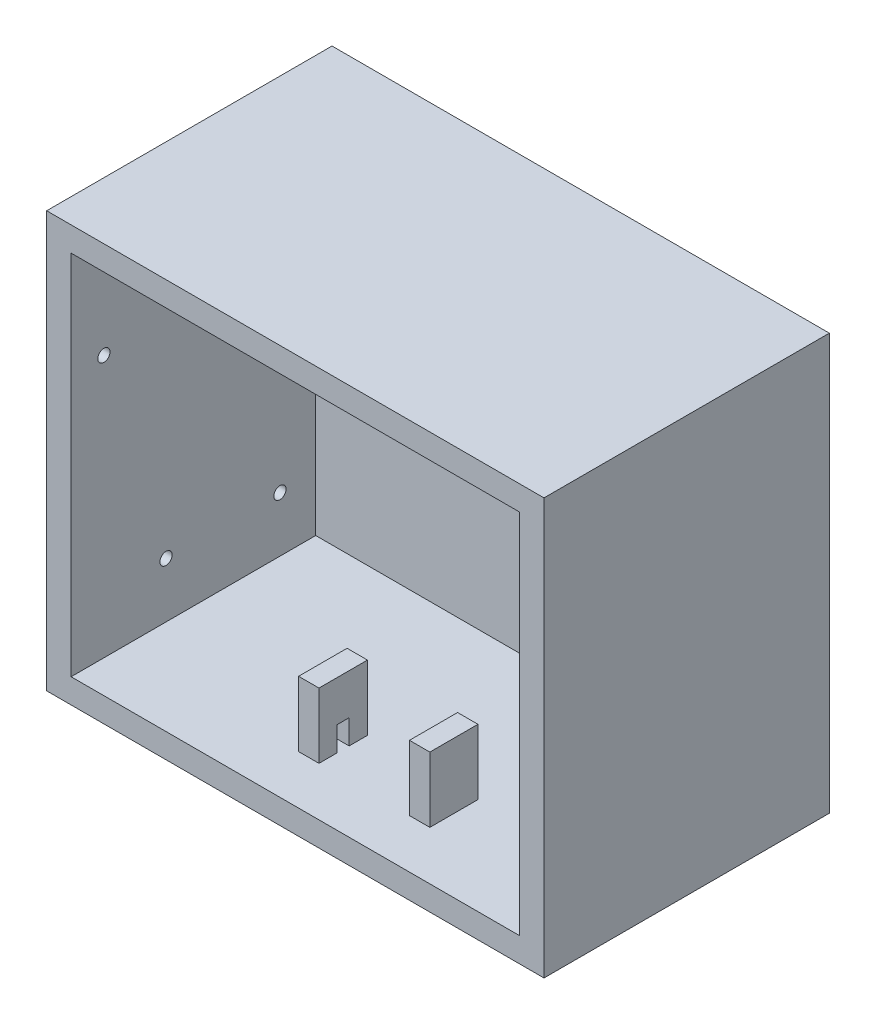
ISO-10303-21;
HEADER;
FILE_DESCRIPTION(('STEP AP214'),'2;1');
FILE_NAME('part.step','',(''),(''),'','','');
FILE_SCHEMA(('AUTOMOTIVE_DESIGN { 1 0 10303 214 1 1 1 1 }'));
ENDSEC;
DATA;
#1=APPLICATION_CONTEXT('core data for automotive mechanical design processes');
#2=APPLICATION_PROTOCOL_DEFINITION('international standard','automotive_design',2000,#1);
#3=PRODUCT_CONTEXT('',#1,'mechanical');
#4=PRODUCT('Part','Part','',(#3));
#5=PRODUCT_RELATED_PRODUCT_CATEGORY('part','',(#4));
#6=PRODUCT_DEFINITION_FORMATION('','',#4);
#7=PRODUCT_DEFINITION_CONTEXT('part definition',#1,'design');
#8=PRODUCT_DEFINITION('design','',#6,#7);
#9=PRODUCT_DEFINITION_SHAPE('','',#8);
#10=(LENGTH_UNIT() NAMED_UNIT(*) SI_UNIT(.MILLI.,.METRE.));
#11=(NAMED_UNIT(*) PLANE_ANGLE_UNIT() SI_UNIT($,.RADIAN.));
#12=(NAMED_UNIT(*) SI_UNIT($,.STERADIAN.) SOLID_ANGLE_UNIT());
#13=UNCERTAINTY_MEASURE_WITH_UNIT(LENGTH_MEASURE(1.E-05),#10,'distance_accuracy_value','');
#14=(GEOMETRIC_REPRESENTATION_CONTEXT(3) GLOBAL_UNCERTAINTY_ASSIGNED_CONTEXT((#13)) GLOBAL_UNIT_ASSIGNED_CONTEXT((#10,
#11,#12)) REPRESENTATION_CONTEXT('',''));
#15=CARTESIAN_POINT('',(0.,0.,0.));
#16=DIRECTION('',(0.,0.,1.));
#17=DIRECTION('',(1.,0.,0.));
#18=AXIS2_PLACEMENT_3D('',#15,#16,#17);
#19=CARTESIAN_POINT('',(0.,0.,70.));
#20=DIRECTION('',(0.,0.,1.));
#21=DIRECTION('',(1.,0.,0.));
#22=AXIS2_PLACEMENT_3D('',#19,#20,#21);
#23=PLANE('',#22);
#24=DIRECTION('',(0.,1.,0.));
#25=VECTOR('',#24,1.);
#26=CARTESIAN_POINT('',(61.,-51.,70.));
#27=LINE('',#26,#25);
#28=CARTESIAN_POINT('',(61.,-51.,70.));
#29=VERTEX_POINT('',#28);
#30=CARTESIAN_POINT('',(61.,51.,70.));
#31=VERTEX_POINT('',#30);
#32=EDGE_CURVE('E293',#29,#31,#27,.T.);
#33=ORIENTED_EDGE('',*,*,#32,.T.);
#34=DIRECTION('',(-1.,0.,0.));
#35=VECTOR('',#34,1.);
#36=CARTESIAN_POINT('',(61.,51.,70.));
#37=LINE('',#36,#35);
#38=CARTESIAN_POINT('',(-61.,51.,70.));
#39=VERTEX_POINT('',#38);
#40=EDGE_CURVE('E296',#31,#39,#37,.T.);
#41=ORIENTED_EDGE('',*,*,#40,.T.);
#42=DIRECTION('',(0.,-1.,0.));
#43=VECTOR('',#42,1.);
#44=CARTESIAN_POINT('',(-61.,-51.,70.));
#45=LINE('',#44,#43);
#46=CARTESIAN_POINT('',(-61.,-51.,70.));
#47=VERTEX_POINT('',#46);
#48=EDGE_CURVE('E299',#39,#47,#45,.T.);
#49=ORIENTED_EDGE('',*,*,#48,.T.);
#50=DIRECTION('',(1.,0.,0.));
#51=VECTOR('',#50,1.);
#52=CARTESIAN_POINT('',(61.,-51.,70.));
#53=LINE('',#52,#51);
#54=EDGE_CURVE('E301',#47,#29,#53,.T.);
#55=ORIENTED_EDGE('',*,*,#54,.T.);
#56=EDGE_LOOP('',(#33,#41,#49,#55));
#57=FACE_BOUND('',#56,.T.);
#58=DIRECTION('',(1.,0.,0.));
#59=VECTOR('',#58,1.);
#60=CARTESIAN_POINT('',(55.,-45.,70.));
#61=LINE('',#60,#59);
#62=CARTESIAN_POINT('',(-55.,-45.,70.));
#63=VERTEX_POINT('',#62);
#64=CARTESIAN_POINT('',(55.,-45.,70.));
#65=VERTEX_POINT('',#64);
#66=EDGE_CURVE('E274',#63,#65,#61,.T.);
#67=ORIENTED_EDGE('',*,*,#66,.F.);
#68=DIRECTION('',(0.,-1.,0.));
#69=VECTOR('',#68,1.);
#70=CARTESIAN_POINT('',(-55.,-45.,70.));
#71=LINE('',#70,#69);
#72=CARTESIAN_POINT('',(-55.,45.,70.));
#73=VERTEX_POINT('',#72);
#74=EDGE_CURVE('E272',#73,#63,#71,.T.);
#75=ORIENTED_EDGE('',*,*,#74,.F.);
#76=DIRECTION('',(-1.,0.,0.));
#77=VECTOR('',#76,1.);
#78=CARTESIAN_POINT('',(55.,45.,70.));
#79=LINE('',#78,#77);
#80=CARTESIAN_POINT('',(55.,45.,70.));
#81=VERTEX_POINT('',#80);
#82=EDGE_CURVE('E279',#81,#73,#79,.T.);
#83=ORIENTED_EDGE('',*,*,#82,.F.);
#84=DIRECTION('',(0.,1.,0.));
#85=VECTOR('',#84,1.);
#86=CARTESIAN_POINT('',(55.,-45.,70.));
#87=LINE('',#86,#85);
#88=EDGE_CURVE('E276',#65,#81,#87,.T.);
#89=ORIENTED_EDGE('',*,*,#88,.F.);
#90=EDGE_LOOP('',(#67,#75,#83,#89));
#91=FACE_BOUND('',#90,.T.);
#92=ADVANCED_FACE('F33',(#57,#91),#23,.T.);
#93=CARTESIAN_POINT('',(0.,0.,0.));
#94=DIRECTION('',(0.,0.,1.));
#95=DIRECTION('',(1.,0.,0.));
#96=AXIS2_PLACEMENT_3D('',#93,#94,#95);
#97=PLANE('',#96);
#98=DIRECTION('',(0.,1.,0.));
#99=VECTOR('',#98,1.);
#100=CARTESIAN_POINT('',(61.,-51.,0.));
#101=LINE('',#100,#99);
#102=CARTESIAN_POINT('',(61.,-51.,0.));
#103=VERTEX_POINT('',#102);
#104=CARTESIAN_POINT('',(61.,51.,0.));
#105=VERTEX_POINT('',#104);
#106=EDGE_CURVE('E292',#103,#105,#101,.T.);
#107=ORIENTED_EDGE('',*,*,#106,.F.);
#108=DIRECTION('',(1.,0.,0.));
#109=VECTOR('',#108,1.);
#110=CARTESIAN_POINT('',(61.,-51.,0.));
#111=LINE('',#110,#109);
#112=CARTESIAN_POINT('',(-61.,-51.,0.));
#113=VERTEX_POINT('',#112);
#114=EDGE_CURVE('E297',#113,#103,#111,.T.);
#115=ORIENTED_EDGE('',*,*,#114,.F.);
#116=DIRECTION('',(0.,-1.,0.));
#117=VECTOR('',#116,1.);
#118=CARTESIAN_POINT('',(-61.,-51.,0.));
#119=LINE('',#118,#117);
#120=CARTESIAN_POINT('',(-61.,51.,0.));
#121=VERTEX_POINT('',#120);
#122=EDGE_CURVE('E309',#121,#113,#119,.T.);
#123=ORIENTED_EDGE('',*,*,#122,.F.);
#124=DIRECTION('',(-1.,0.,0.));
#125=VECTOR('',#124,1.);
#126=CARTESIAN_POINT('',(61.,51.,0.));
#127=LINE('',#126,#125);
#128=EDGE_CURVE('E306',#105,#121,#127,.T.);
#129=ORIENTED_EDGE('',*,*,#128,.F.);
#130=EDGE_LOOP('',(#107,#115,#123,#129));
#131=FACE_BOUND('',#130,.T.);
#132=ADVANCED_FACE('F383',(#131),#97,.F.);
#133=CARTESIAN_POINT('',(61.,-51.,70.));
#134=DIRECTION('',(-1.,0.,0.));
#135=DIRECTION('',(0.,0.,1.));
#136=AXIS2_PLACEMENT_3D('',#133,#134,#135);
#137=PLANE('',#136);
#138=DIRECTION('',(0.,0.,-1.));
#139=VECTOR('',#138,1.);
#140=CARTESIAN_POINT('',(61.,-51.,70.));
#141=LINE('',#140,#139);
#142=EDGE_CURVE('E303',#29,#103,#141,.T.);
#143=ORIENTED_EDGE('',*,*,#142,.T.);
#144=ORIENTED_EDGE('',*,*,#106,.T.);
#145=DIRECTION('',(0.,0.,-1.));
#146=VECTOR('',#145,1.);
#147=CARTESIAN_POINT('',(61.,51.,70.));
#148=LINE('',#147,#146);
#149=EDGE_CURVE('E319',#31,#105,#148,.T.);
#150=ORIENTED_EDGE('',*,*,#149,.F.);
#151=ORIENTED_EDGE('',*,*,#32,.F.);
#152=EDGE_LOOP('',(#143,#144,#150,#151));
#153=FACE_BOUND('',#152,.T.);
#154=ADVANCED_FACE('F35',(#153),#137,.F.);
#155=CARTESIAN_POINT('',(61.,51.,70.));
#156=DIRECTION('',(0.,-1.,0.));
#157=DIRECTION('',(1.,0.,0.));
#158=AXIS2_PLACEMENT_3D('',#155,#156,#157);
#159=PLANE('',#158);
#160=ORIENTED_EDGE('',*,*,#149,.T.);
#161=ORIENTED_EDGE('',*,*,#128,.T.);
#162=DIRECTION('',(0.,0.,-1.));
#163=VECTOR('',#162,1.);
#164=CARTESIAN_POINT('',(-61.,51.,70.));
#165=LINE('',#164,#163);
#166=EDGE_CURVE('E317',#39,#121,#165,.T.);
#167=ORIENTED_EDGE('',*,*,#166,.F.);
#168=ORIENTED_EDGE('',*,*,#40,.F.);
#169=EDGE_LOOP('',(#160,#161,#167,#168));
#170=FACE_BOUND('',#169,.T.);
#171=ADVANCED_FACE('F402',(#170),#159,.F.);
#172=CARTESIAN_POINT('',(-61.,-51.,70.));
#173=DIRECTION('',(1.,0.,0.));
#174=DIRECTION('',(0.,0.,-1.));
#175=AXIS2_PLACEMENT_3D('',#172,#173,#174);
#176=PLANE('',#175);
#177=CARTESIAN_POINT('',(-61.,19.26,13.7));
#178=DIRECTION('',(-1.,0.,0.));
#179=DIRECTION('',(0.,0.,1.));
#180=AXIS2_PLACEMENT_3D('',#177,#178,#179);
#181=CIRCLE('',#180,1.5);
#182=CARTESIAN_POINT('',(-61.,19.26,15.2));
#183=VERTEX_POINT('',#182);
#184=EDGE_CURVE('E239',#183,#183,#181,.T.);
#185=ORIENTED_EDGE('',*,*,#184,.F.);
#186=EDGE_LOOP('',(#185));
#187=FACE_BOUND('',#186,.T.);
#188=CARTESIAN_POINT('',(-61.,19.26,61.96));
#189=DIRECTION('',(-1.,0.,0.));
#190=DIRECTION('',(0.,0.,1.));
#191=AXIS2_PLACEMENT_3D('',#188,#189,#190);
#192=CIRCLE('',#191,1.49999999999999);
#193=CARTESIAN_POINT('',(-61.,19.26,63.46));
#194=VERTEX_POINT('',#193);
#195=EDGE_CURVE('E251',#194,#194,#192,.T.);
#196=ORIENTED_EDGE('',*,*,#195,.F.);
#197=EDGE_LOOP('',(#196));
#198=FACE_BOUND('',#197,.T.);
#199=CARTESIAN_POINT('',(-61.,-31.5,18.78));
#200=DIRECTION('',(-1.,0.,0.));
#201=DIRECTION('',(0.,0.,1.));
#202=AXIS2_PLACEMENT_3D('',#199,#200,#201);
#203=CIRCLE('',#202,1.5);
#204=CARTESIAN_POINT('',(-61.,-31.5,20.28));
#205=VERTEX_POINT('',#204);
#206=EDGE_CURVE('E255',#205,#205,#203,.T.);
#207=ORIENTED_EDGE('',*,*,#206,.F.);
#208=EDGE_LOOP('',(#207));
#209=FACE_BOUND('',#208,.T.);
#210=CARTESIAN_POINT('',(-61.,-31.5,46.72));
#211=DIRECTION('',(-1.,0.,0.));
#212=DIRECTION('',(0.,0.,1.));
#213=AXIS2_PLACEMENT_3D('',#210,#211,#212);
#214=CIRCLE('',#213,1.5);
#215=CARTESIAN_POINT('',(-61.,-31.5,48.22));
#216=VERTEX_POINT('',#215);
#217=EDGE_CURVE('E259',#216,#216,#214,.T.);
#218=ORIENTED_EDGE('',*,*,#217,.F.);
#219=EDGE_LOOP('',(#218));
#220=FACE_BOUND('',#219,.T.);
#221=ORIENTED_EDGE('',*,*,#166,.T.);
#222=ORIENTED_EDGE('',*,*,#122,.T.);
#223=DIRECTION('',(0.,0.,-1.));
#224=VECTOR('',#223,1.);
#225=CARTESIAN_POINT('',(-61.,-51.,70.));
#226=LINE('',#225,#224);
#227=EDGE_CURVE('E315',#47,#113,#226,.T.);
#228=ORIENTED_EDGE('',*,*,#227,.F.);
#229=ORIENTED_EDGE('',*,*,#48,.F.);
#230=EDGE_LOOP('',(#221,#222,#228,#229));
#231=FACE_BOUND('',#230,.T.);
#232=ADVANCED_FACE('F399',(#187,#198,#209,#220,#231),#176,.F.);
#233=CARTESIAN_POINT('',(61.,-51.,70.));
#234=DIRECTION('',(0.,1.,0.));
#235=DIRECTION('',(-1.,0.,0.));
#236=AXIS2_PLACEMENT_3D('',#233,#234,#235);
#237=PLANE('',#236);
#238=ORIENTED_EDGE('',*,*,#227,.T.);
#239=ORIENTED_EDGE('',*,*,#114,.T.);
#240=ORIENTED_EDGE('',*,*,#142,.F.);
#241=ORIENTED_EDGE('',*,*,#54,.F.);
#242=EDGE_LOOP('',(#238,#239,#240,#241));
#243=FACE_BOUND('',#242,.T.);
#244=ADVANCED_FACE('F396',(#243),#237,.F.);
#245=CARTESIAN_POINT('',(-55.,-45.,70.));
#246=DIRECTION('',(1.,0.,0.));
#247=DIRECTION('',(0.,0.,-1.));
#248=AXIS2_PLACEMENT_3D('',#245,#246,#247);
#249=PLANE('',#248);
#250=CARTESIAN_POINT('',(-55.,19.26,13.7));
#251=DIRECTION('',(1.,0.,0.));
#252=DIRECTION('',(0.,0.,-1.));
#253=AXIS2_PLACEMENT_3D('',#250,#251,#252);
#254=CIRCLE('',#253,1.5);
#255=CARTESIAN_POINT('',(-55.,19.26,12.2));
#256=VERTEX_POINT('',#255);
#257=EDGE_CURVE('E250',#256,#256,#254,.T.);
#258=ORIENTED_EDGE('',*,*,#257,.F.);
#259=EDGE_LOOP('',(#258));
#260=FACE_BOUND('',#259,.T.);
#261=CARTESIAN_POINT('',(-55.,19.26,61.96));
#262=DIRECTION('',(1.,0.,0.));
#263=DIRECTION('',(0.,0.,-1.));
#264=AXIS2_PLACEMENT_3D('',#261,#262,#263);
#265=CIRCLE('',#264,1.49999999999999);
#266=CARTESIAN_POINT('',(-55.,19.26,60.46));
#267=VERTEX_POINT('',#266);
#268=EDGE_CURVE('E254',#267,#267,#265,.T.);
#269=ORIENTED_EDGE('',*,*,#268,.F.);
#270=EDGE_LOOP('',(#269));
#271=FACE_BOUND('',#270,.T.);
#272=CARTESIAN_POINT('',(-55.,-31.5,18.78));
#273=DIRECTION('',(1.,0.,0.));
#274=DIRECTION('',(0.,0.,-1.));
#275=AXIS2_PLACEMENT_3D('',#272,#273,#274);
#276=CIRCLE('',#275,1.5);
#277=CARTESIAN_POINT('',(-55.,-31.5,17.28));
#278=VERTEX_POINT('',#277);
#279=EDGE_CURVE('E266',#278,#278,#276,.T.);
#280=ORIENTED_EDGE('',*,*,#279,.F.);
#281=EDGE_LOOP('',(#280));
#282=FACE_BOUND('',#281,.T.);
#283=CARTESIAN_POINT('',(-55.,-31.5,46.72));
#284=DIRECTION('',(1.,0.,0.));
#285=DIRECTION('',(0.,0.,-1.));
#286=AXIS2_PLACEMENT_3D('',#283,#284,#285);
#287=CIRCLE('',#286,1.5);
#288=CARTESIAN_POINT('',(-55.,-31.5,45.22));
#289=VERTEX_POINT('',#288);
#290=EDGE_CURVE('E258',#289,#289,#287,.T.);
#291=ORIENTED_EDGE('',*,*,#290,.F.);
#292=EDGE_LOOP('',(#291));
#293=FACE_BOUND('',#292,.T.);
#294=DIRECTION('',(0.,-1.,0.));
#295=VECTOR('',#294,1.);
#296=CARTESIAN_POINT('',(-55.,-45.,9.99999999999999));
#297=LINE('',#296,#295);
#298=CARTESIAN_POINT('',(-55.,45.,10.));
#299=VERTEX_POINT('',#298);
#300=CARTESIAN_POINT('',(-55.,-45.,9.99999999999999));
#301=VERTEX_POINT('',#300);
#302=EDGE_CURVE('E269',#299,#301,#297,.T.);
#303=ORIENTED_EDGE('',*,*,#302,.F.);
#304=DIRECTION('',(0.,0.,-1.));
#305=VECTOR('',#304,1.);
#306=CARTESIAN_POINT('',(-55.,45.,70.));
#307=LINE('',#306,#305);
#308=EDGE_CURVE('E281',#73,#299,#307,.T.);
#309=ORIENTED_EDGE('',*,*,#308,.F.);
#310=ORIENTED_EDGE('',*,*,#74,.T.);
#311=DIRECTION('',(0.,0.,-1.));
#312=VECTOR('',#311,1.);
#313=CARTESIAN_POINT('',(-55.,-45.,70.));
#314=LINE('',#313,#312);
#315=EDGE_CURVE('E289',#63,#301,#314,.T.);
#316=ORIENTED_EDGE('',*,*,#315,.T.);
#317=EDGE_LOOP('',(#303,#309,#310,#316));
#318=FACE_BOUND('',#317,.T.);
#319=ADVANCED_FACE('F393',(#260,#271,#282,#293,#318),#249,.T.);
#320=CARTESIAN_POINT('',(55.,-45.,70.));
#321=DIRECTION('',(0.,1.,0.));
#322=DIRECTION('',(-1.,0.,0.));
#323=AXIS2_PLACEMENT_3D('',#320,#321,#322);
#324=PLANE('',#323);
#325=DIRECTION('',(0.,0.,-1.));
#326=VECTOR('',#325,1.);
#327=CARTESIAN_POINT('',(-6.19999999999999,-45.,70.));
#328=LINE('',#327,#326);
#329=CARTESIAN_POINT('',(-6.19999999999999,-45.,50.6));
#330=VERTEX_POINT('',#329);
#331=CARTESIAN_POINT('',(-6.19999999999999,-45.,46.102417105453));
#332=VERTEX_POINT('',#331);
#333=EDGE_CURVE('E41',#330,#332,#328,.T.);
#334=ORIENTED_EDGE('',*,*,#333,.F.);
#335=DIRECTION('',(-1.,0.,0.));
#336=VECTOR('',#335,1.);
#337=CARTESIAN_POINT('',(-1.19999999999998,-45.,50.6));
#338=LINE('',#337,#336);
#339=CARTESIAN_POINT('',(-11.2,-45.,50.6));
#340=VERTEX_POINT('',#339);
#341=EDGE_CURVE('E177',#330,#340,#338,.T.);
#342=ORIENTED_EDGE('',*,*,#341,.T.);
#343=DIRECTION('',(0.,0.,1.));
#344=VECTOR('',#343,1.);
#345=CARTESIAN_POINT('',(-11.2,-45.,70.));
#346=LINE('',#345,#344);
#347=CARTESIAN_POINT('',(-11.2,-45.,46.102417105453));
#348=VERTEX_POINT('',#347);
#349=EDGE_CURVE('E187',#348,#340,#346,.T.);
#350=ORIENTED_EDGE('',*,*,#349,.F.);
#351=DIRECTION('',(-1.,0.,0.));
#352=VECTOR('',#351,1.);
#353=CARTESIAN_POINT('',(55.,-45.,46.102417105453));
#354=LINE('',#353,#352);
#355=EDGE_CURVE('E348',#332,#348,#354,.T.);
#356=ORIENTED_EDGE('',*,*,#355,.F.);
#357=EDGE_LOOP('',(#334,#342,#350,#356));
#358=FACE_BOUND('',#357,.T.);
#359=DIRECTION('',(-1.,0.,0.));
#360=VECTOR('',#359,1.);
#361=CARTESIAN_POINT('',(-1.19999999999998,-45.,53.6));
#362=LINE('',#361,#360);
#363=CARTESIAN_POINT('',(-6.19999999999999,-45.,53.6));
#364=VERTEX_POINT('',#363);
#365=CARTESIAN_POINT('',(-11.2,-45.,53.6));
#366=VERTEX_POINT('',#365);
#367=EDGE_CURVE('E192',#364,#366,#362,.T.);
#368=ORIENTED_EDGE('',*,*,#367,.F.);
#369=CARTESIAN_POINT('',(-6.19999999999999,-45.,58.));
#370=VERTEX_POINT('',#369);
#371=EDGE_CURVE('E11',#370,#364,#328,.T.);
#372=ORIENTED_EDGE('',*,*,#371,.F.);
#373=DIRECTION('',(1.,0.,0.));
#374=VECTOR('',#373,1.);
#375=CARTESIAN_POINT('',(55.,-45.,58.));
#376=LINE('',#375,#374);
#377=CARTESIAN_POINT('',(-11.2,-45.,58.));
#378=VERTEX_POINT('',#377);
#379=EDGE_CURVE('E344',#378,#370,#376,.T.);
#380=ORIENTED_EDGE('',*,*,#379,.F.);
#381=EDGE_CURVE('E347',#366,#378,#346,.T.);
#382=ORIENTED_EDGE('',*,*,#381,.F.);
#383=EDGE_LOOP('',(#368,#372,#380,#382));
#384=FACE_BOUND('',#383,.T.);
#385=DIRECTION('',(0.,0.,1.));
#386=VECTOR('',#385,1.);
#387=CARTESIAN_POINT('',(16.,-45.,70.));
#388=LINE('',#387,#386);
#389=CARTESIAN_POINT('',(16.,-45.,46.2));
#390=VERTEX_POINT('',#389);
#391=CARTESIAN_POINT('',(16.,-45.,58.));
#392=VERTEX_POINT('',#391);
#393=EDGE_CURVE('E341',#390,#392,#388,.T.);
#394=ORIENTED_EDGE('',*,*,#393,.F.);
#395=DIRECTION('',(-1.,0.,0.));
#396=VECTOR('',#395,1.);
#397=CARTESIAN_POINT('',(55.,-45.,46.2));
#398=LINE('',#397,#396);
#399=CARTESIAN_POINT('',(21.,-45.,46.2));
#400=VERTEX_POINT('',#399);
#401=EDGE_CURVE('E324',#400,#390,#398,.T.);
#402=ORIENTED_EDGE('',*,*,#401,.F.);
#403=DIRECTION('',(0.,0.,-1.));
#404=VECTOR('',#403,1.);
#405=CARTESIAN_POINT('',(21.,-45.,70.));
#406=LINE('',#405,#404);
#407=CARTESIAN_POINT('',(21.,-45.,58.));
#408=VERTEX_POINT('',#407);
#409=EDGE_CURVE('E335',#408,#400,#406,.T.);
#410=ORIENTED_EDGE('',*,*,#409,.F.);
#411=DIRECTION('',(1.,0.,0.));
#412=VECTOR('',#411,1.);
#413=CARTESIAN_POINT('',(55.,-45.,58.));
#414=LINE('',#413,#412);
#415=EDGE_CURVE('E338',#392,#408,#414,.T.);
#416=ORIENTED_EDGE('',*,*,#415,.F.);
#417=EDGE_LOOP('',(#394,#402,#410,#416));
#418=FACE_BOUND('',#417,.T.);
#419=DIRECTION('',(1.,0.,0.));
#420=VECTOR('',#419,1.);
#421=CARTESIAN_POINT('',(55.,-45.,9.99999999999999));
#422=LINE('',#421,#420);
#423=CARTESIAN_POINT('',(55.,-45.,9.99999999999999));
#424=VERTEX_POINT('',#423);
#425=EDGE_CURVE('E265',#301,#424,#422,.T.);
#426=ORIENTED_EDGE('',*,*,#425,.F.);
#427=ORIENTED_EDGE('',*,*,#315,.F.);
#428=ORIENTED_EDGE('',*,*,#66,.T.);
#429=DIRECTION('',(0.,0.,-1.));
#430=VECTOR('',#429,1.);
#431=CARTESIAN_POINT('',(55.,-45.,70.));
#432=LINE('',#431,#430);
#433=EDGE_CURVE('E286',#65,#424,#432,.T.);
#434=ORIENTED_EDGE('',*,*,#433,.T.);
#435=EDGE_LOOP('',(#426,#427,#428,#434));
#436=FACE_BOUND('',#435,.T.);
#437=ADVANCED_FACE('F358',(#358,#384,#418,#436),#324,.T.);
#438=CARTESIAN_POINT('',(55.,-45.,70.));
#439=DIRECTION('',(-1.,0.,0.));
#440=DIRECTION('',(0.,0.,1.));
#441=AXIS2_PLACEMENT_3D('',#438,#439,#440);
#442=PLANE('',#441);
#443=DIRECTION('',(0.,1.,0.));
#444=VECTOR('',#443,1.);
#445=CARTESIAN_POINT('',(55.,-45.,9.99999999999999));
#446=LINE('',#445,#444);
#447=CARTESIAN_POINT('',(55.,45.,10.));
#448=VERTEX_POINT('',#447);
#449=EDGE_CURVE('E262',#424,#448,#446,.T.);
#450=ORIENTED_EDGE('',*,*,#449,.F.);
#451=ORIENTED_EDGE('',*,*,#433,.F.);
#452=ORIENTED_EDGE('',*,*,#88,.T.);
#453=DIRECTION('',(0.,0.,-1.));
#454=VECTOR('',#453,1.);
#455=CARTESIAN_POINT('',(55.,45.,70.));
#456=LINE('',#455,#454);
#457=EDGE_CURVE('E283',#81,#448,#456,.T.);
#458=ORIENTED_EDGE('',*,*,#457,.T.);
#459=EDGE_LOOP('',(#450,#451,#452,#458));
#460=FACE_BOUND('',#459,.T.);
#461=ADVANCED_FACE('F474',(#460),#442,.T.);
#462=CARTESIAN_POINT('',(55.,45.,70.));
#463=DIRECTION('',(0.,-1.,0.));
#464=DIRECTION('',(1.,0.,0.));
#465=AXIS2_PLACEMENT_3D('',#462,#463,#464);
#466=PLANE('',#465);
#467=DIRECTION('',(-1.,0.,0.));
#468=VECTOR('',#467,1.);
#469=CARTESIAN_POINT('',(55.,45.,10.));
#470=LINE('',#469,#468);
#471=EDGE_CURVE('E321',#448,#299,#470,.T.);
#472=ORIENTED_EDGE('',*,*,#471,.F.);
#473=ORIENTED_EDGE('',*,*,#457,.F.);
#474=ORIENTED_EDGE('',*,*,#82,.T.);
#475=ORIENTED_EDGE('',*,*,#308,.T.);
#476=EDGE_LOOP('',(#472,#473,#474,#475));
#477=FACE_BOUND('',#476,.T.);
#478=ADVANCED_FACE('F483',(#477),#466,.T.);
#479=CARTESIAN_POINT('',(-61.,51.,10.));
#480=DIRECTION('',(0.,0.,1.));
#481=DIRECTION('',(0.,-1.,0.));
#482=AXIS2_PLACEMENT_3D('',#479,#480,#481);
#483=PLANE('',#482);
#484=ORIENTED_EDGE('',*,*,#471,.T.);
#485=ORIENTED_EDGE('',*,*,#302,.T.);
#486=ORIENTED_EDGE('',*,*,#425,.T.);
#487=ORIENTED_EDGE('',*,*,#449,.T.);
#488=EDGE_LOOP('',(#484,#485,#486,#487));
#489=FACE_BOUND('',#488,.T.);
#490=ADVANCED_FACE('F491',(#489),#483,.T.);
#491=CARTESIAN_POINT('',(-51.,-31.5,46.72));
#492=DIRECTION('',(-1.,0.,0.));
#493=DIRECTION('',(0.,0.,1.));
#494=AXIS2_PLACEMENT_3D('',#491,#492,#493);
#495=CYLINDRICAL_SURFACE('',#494,1.5);
#496=ORIENTED_EDGE('',*,*,#290,.T.);
#497=EDGE_LOOP('',(#496));
#498=FACE_BOUND('',#497,.T.);
#499=ORIENTED_EDGE('',*,*,#217,.T.);
#500=EDGE_LOOP('',(#499));
#501=FACE_BOUND('',#500,.T.);
#502=ADVANCED_FACE('F500',(#498,#501),#495,.F.);
#503=CARTESIAN_POINT('',(-51.,-31.5,18.78));
#504=DIRECTION('',(-1.,0.,0.));
#505=DIRECTION('',(0.,0.,1.));
#506=AXIS2_PLACEMENT_3D('',#503,#504,#505);
#507=CYLINDRICAL_SURFACE('',#506,1.5);
#508=ORIENTED_EDGE('',*,*,#279,.T.);
#509=EDGE_LOOP('',(#508));
#510=FACE_BOUND('',#509,.T.);
#511=ORIENTED_EDGE('',*,*,#206,.T.);
#512=EDGE_LOOP('',(#511));
#513=FACE_BOUND('',#512,.T.);
#514=ADVANCED_FACE('F510',(#510,#513),#507,.F.);
#515=CARTESIAN_POINT('',(-51.,19.26,61.96));
#516=DIRECTION('',(-1.,0.,0.));
#517=DIRECTION('',(0.,0.,1.));
#518=AXIS2_PLACEMENT_3D('',#515,#516,#517);
#519=CYLINDRICAL_SURFACE('',#518,1.49999999999999);
#520=ORIENTED_EDGE('',*,*,#268,.T.);
#521=EDGE_LOOP('',(#520));
#522=FACE_BOUND('',#521,.T.);
#523=ORIENTED_EDGE('',*,*,#195,.T.);
#524=EDGE_LOOP('',(#523));
#525=FACE_BOUND('',#524,.T.);
#526=ADVANCED_FACE('F519',(#522,#525),#519,.F.);
#527=CARTESIAN_POINT('',(-51.,19.26,13.7));
#528=DIRECTION('',(-1.,0.,0.));
#529=DIRECTION('',(0.,0.,1.));
#530=AXIS2_PLACEMENT_3D('',#527,#528,#529);
#531=CYLINDRICAL_SURFACE('',#530,1.5);
#532=ORIENTED_EDGE('',*,*,#257,.T.);
#533=EDGE_LOOP('',(#532));
#534=FACE_BOUND('',#533,.T.);
#535=ORIENTED_EDGE('',*,*,#184,.T.);
#536=EDGE_LOOP('',(#535));
#537=FACE_BOUND('',#536,.T.);
#538=ADVANCED_FACE('F528',(#534,#537),#531,.F.);
#539=CARTESIAN_POINT('',(16.,-29.,58.));
#540=DIRECTION('',(-1.,0.,0.));
#541=DIRECTION('',(0.,-1.,0.));
#542=AXIS2_PLACEMENT_3D('',#539,#540,#541);
#543=PLANE('',#542);
#544=DIRECTION('',(0.,-1.,0.));
#545=VECTOR('',#544,1.);
#546=CARTESIAN_POINT('',(16.,-29.,46.2));
#547=LINE('',#546,#545);
#548=CARTESIAN_POINT('',(16.,-29.,46.2));
#549=VERTEX_POINT('',#548);
#550=EDGE_CURVE('E235',#549,#390,#547,.T.);
#551=ORIENTED_EDGE('',*,*,#550,.T.);
#552=ORIENTED_EDGE('',*,*,#393,.T.);
#553=DIRECTION('',(0.,-1.,0.));
#554=VECTOR('',#553,1.);
#555=CARTESIAN_POINT('',(16.,-29.,58.));
#556=LINE('',#555,#554);
#557=CARTESIAN_POINT('',(16.,-29.,58.));
#558=VERTEX_POINT('',#557);
#559=EDGE_CURVE('E236',#558,#392,#556,.T.);
#560=ORIENTED_EDGE('',*,*,#559,.F.);
#561=DIRECTION('',(0.,0.,-1.));
#562=VECTOR('',#561,1.);
#563=CARTESIAN_POINT('',(16.,-29.,58.));
#564=LINE('',#563,#562);
#565=EDGE_CURVE('E216',#558,#549,#564,.T.);
#566=ORIENTED_EDGE('',*,*,#565,.T.);
#567=EDGE_LOOP('',(#551,#552,#560,#566));
#568=FACE_BOUND('',#567,.T.);
#569=ADVANCED_FACE('F538',(#568),#543,.T.);
#570=CARTESIAN_POINT('',(16.,-29.,58.));
#571=DIRECTION('',(0.,0.,1.));
#572=DIRECTION('',(1.,0.,0.));
#573=AXIS2_PLACEMENT_3D('',#570,#571,#572);
#574=PLANE('',#573);
#575=ORIENTED_EDGE('',*,*,#559,.T.);
#576=ORIENTED_EDGE('',*,*,#415,.T.);
#577=DIRECTION('',(0.,-1.,0.));
#578=VECTOR('',#577,1.);
#579=CARTESIAN_POINT('',(21.,-29.,58.));
#580=LINE('',#579,#578);
#581=CARTESIAN_POINT('',(21.,-29.,58.));
#582=VERTEX_POINT('',#581);
#583=EDGE_CURVE('E240',#582,#408,#580,.T.);
#584=ORIENTED_EDGE('',*,*,#583,.F.);
#585=DIRECTION('',(-1.,0.,0.));
#586=VECTOR('',#585,1.);
#587=CARTESIAN_POINT('',(16.,-29.,58.));
#588=LINE('',#587,#586);
#589=EDGE_CURVE('E232',#582,#558,#588,.T.);
#590=ORIENTED_EDGE('',*,*,#589,.T.);
#591=EDGE_LOOP('',(#575,#576,#584,#590));
#592=FACE_BOUND('',#591,.T.);
#593=ADVANCED_FACE('F544',(#592),#574,.T.);
#594=CARTESIAN_POINT('',(21.,-29.,58.));
#595=DIRECTION('',(1.,0.,0.));
#596=DIRECTION('',(0.,1.,0.));
#597=AXIS2_PLACEMENT_3D('',#594,#595,#596);
#598=PLANE('',#597);
#599=ORIENTED_EDGE('',*,*,#583,.T.);
#600=ORIENTED_EDGE('',*,*,#409,.T.);
#601=DIRECTION('',(0.,-1.,0.));
#602=VECTOR('',#601,1.);
#603=CARTESIAN_POINT('',(21.,-29.,46.2));
#604=LINE('',#603,#602);
#605=CARTESIAN_POINT('',(21.,-29.,46.2));
#606=VERTEX_POINT('',#605);
#607=EDGE_CURVE('E243',#606,#400,#604,.T.);
#608=ORIENTED_EDGE('',*,*,#607,.F.);
#609=DIRECTION('',(0.,0.,1.));
#610=VECTOR('',#609,1.);
#611=CARTESIAN_POINT('',(21.,-29.,58.));
#612=LINE('',#611,#610);
#613=EDGE_CURVE('E229',#606,#582,#612,.T.);
#614=ORIENTED_EDGE('',*,*,#613,.T.);
#615=EDGE_LOOP('',(#599,#600,#608,#614));
#616=FACE_BOUND('',#615,.T.);
#617=ADVANCED_FACE('F552',(#616),#598,.T.);
#618=CARTESIAN_POINT('',(16.,-29.,46.2));
#619=DIRECTION('',(0.,0.,-1.));
#620=DIRECTION('',(-1.,0.,0.));
#621=AXIS2_PLACEMENT_3D('',#618,#619,#620);
#622=PLANE('',#621);
#623=ORIENTED_EDGE('',*,*,#607,.T.);
#624=ORIENTED_EDGE('',*,*,#401,.T.);
#625=ORIENTED_EDGE('',*,*,#550,.F.);
#626=DIRECTION('',(1.,0.,0.));
#627=VECTOR('',#626,1.);
#628=CARTESIAN_POINT('',(16.,-29.,46.2));
#629=LINE('',#628,#627);
#630=EDGE_CURVE('E226',#549,#606,#629,.T.);
#631=ORIENTED_EDGE('',*,*,#630,.T.);
#632=EDGE_LOOP('',(#623,#624,#625,#631));
#633=FACE_BOUND('',#632,.T.);
#634=ADVANCED_FACE('F560',(#633),#622,.T.);
#635=CARTESIAN_POINT('',(0.,-29.,0.));
#636=DIRECTION('',(0.,-1.,0.));
#637=DIRECTION('',(0.,0.,-1.));
#638=AXIS2_PLACEMENT_3D('',#635,#636,#637);
#639=PLANE('',#638);
#640=ORIENTED_EDGE('',*,*,#565,.F.);
#641=ORIENTED_EDGE('',*,*,#589,.F.);
#642=ORIENTED_EDGE('',*,*,#613,.F.);
#643=ORIENTED_EDGE('',*,*,#630,.F.);
#644=EDGE_LOOP('',(#640,#641,#642,#643));
#645=FACE_BOUND('',#644,.T.);
#646=ADVANCED_FACE('F568',(#645),#639,.F.);
#647=CARTESIAN_POINT('',(-6.19999999999999,-29.,58.));
#648=DIRECTION('',(1.,0.,0.));
#649=DIRECTION('',(0.,0.,-1.));
#650=AXIS2_PLACEMENT_3D('',#647,#648,#649);
#651=PLANE('',#650);
#652=DIRECTION('',(0.,-1.,0.));
#653=VECTOR('',#652,1.);
#654=CARTESIAN_POINT('',(-6.19999999999999,-29.,53.6));
#655=LINE('',#654,#653);
#656=CARTESIAN_POINT('',(-6.19999999999999,-39.,53.6));
#657=VERTEX_POINT('',#656);
#658=EDGE_CURVE('E198',#657,#364,#655,.T.);
#659=ORIENTED_EDGE('',*,*,#658,.F.);
#660=DIRECTION('',(0.,0.,1.));
#661=VECTOR('',#660,1.);
#662=CARTESIAN_POINT('',(-6.19999999999999,-39.,58.));
#663=LINE('',#662,#661);
#664=CARTESIAN_POINT('',(-6.19999999999999,-39.,50.6));
#665=VERTEX_POINT('',#664);
#666=EDGE_CURVE('E194',#665,#657,#663,.T.);
#667=ORIENTED_EDGE('',*,*,#666,.F.);
#668=DIRECTION('',(0.,1.,0.));
#669=VECTOR('',#668,1.);
#670=CARTESIAN_POINT('',(-6.19999999999999,-29.,50.6));
#671=LINE('',#670,#669);
#672=EDGE_CURVE('E175',#330,#665,#671,.T.);
#673=ORIENTED_EDGE('',*,*,#672,.F.);
#674=ORIENTED_EDGE('',*,*,#333,.T.);
#675=DIRECTION('',(0.,-1.,0.));
#676=VECTOR('',#675,1.);
#677=CARTESIAN_POINT('',(-6.19999999999999,-29.,46.102417105453));
#678=LINE('',#677,#676);
#679=CARTESIAN_POINT('',(-6.19999999999999,-29.,46.102417105453));
#680=VERTEX_POINT('',#679);
#681=EDGE_CURVE('E213',#680,#332,#678,.T.);
#682=ORIENTED_EDGE('',*,*,#681,.F.);
#683=DIRECTION('',(0.,0.,1.));
#684=VECTOR('',#683,1.);
#685=CARTESIAN_POINT('',(-6.19999999999999,-29.,58.));
#686=LINE('',#685,#684);
#687=CARTESIAN_POINT('',(-6.19999999999999,-29.,58.));
#688=VERTEX_POINT('',#687);
#689=EDGE_CURVE('E200',#680,#688,#686,.T.);
#690=ORIENTED_EDGE('',*,*,#689,.T.);
#691=DIRECTION('',(0.,-1.,0.));
#692=VECTOR('',#691,1.);
#693=CARTESIAN_POINT('',(-6.19999999999999,-29.,58.));
#694=LINE('',#693,#692);
#695=EDGE_CURVE('E212',#688,#370,#694,.T.);
#696=ORIENTED_EDGE('',*,*,#695,.T.);
#697=ORIENTED_EDGE('',*,*,#371,.T.);
#698=EDGE_LOOP('',(#659,#667,#673,#674,#682,#690,#696,#697));
#699=FACE_BOUND('',#698,.T.);
#700=ADVANCED_FACE('F355',(#699),#651,.T.);
#701=CARTESIAN_POINT('',(-6.19999999999999,-29.,46.102417105453));
#702=DIRECTION('',(0.,0.,-1.));
#703=DIRECTION('',(-1.,0.,0.));
#704=AXIS2_PLACEMENT_3D('',#701,#702,#703);
#705=PLANE('',#704);
#706=ORIENTED_EDGE('',*,*,#681,.T.);
#707=ORIENTED_EDGE('',*,*,#355,.T.);
#708=DIRECTION('',(0.,-1.,0.));
#709=VECTOR('',#708,1.);
#710=CARTESIAN_POINT('',(-11.2,-29.,46.102417105453));
#711=LINE('',#710,#709);
#712=CARTESIAN_POINT('',(-11.2,-29.,46.102417105453));
#713=VERTEX_POINT('',#712);
#714=EDGE_CURVE('E217',#713,#348,#711,.T.);
#715=ORIENTED_EDGE('',*,*,#714,.F.);
#716=DIRECTION('',(1.,0.,0.));
#717=VECTOR('',#716,1.);
#718=CARTESIAN_POINT('',(-6.19999999999999,-29.,46.102417105453));
#719=LINE('',#718,#717);
#720=EDGE_CURVE('E209',#713,#680,#719,.T.);
#721=ORIENTED_EDGE('',*,*,#720,.T.);
#722=EDGE_LOOP('',(#706,#707,#715,#721));
#723=FACE_BOUND('',#722,.T.);
#724=ADVANCED_FACE('F360',(#723),#705,.T.);
#725=CARTESIAN_POINT('',(-11.2,-29.,58.));
#726=DIRECTION('',(-1.,0.,0.));
#727=DIRECTION('',(0.,0.,1.));
#728=AXIS2_PLACEMENT_3D('',#725,#726,#727);
#729=PLANE('',#728);
#730=DIRECTION('',(0.,1.,0.));
#731=VECTOR('',#730,1.);
#732=CARTESIAN_POINT('',(-11.2,-45.,53.6));
#733=LINE('',#732,#731);
#734=CARTESIAN_POINT('',(-11.2,-39.,53.6));
#735=VERTEX_POINT('',#734);
#736=EDGE_CURVE('E56',#366,#735,#733,.T.);
#737=ORIENTED_EDGE('',*,*,#736,.F.);
#738=ORIENTED_EDGE('',*,*,#381,.T.);
#739=DIRECTION('',(0.,-1.,0.));
#740=VECTOR('',#739,1.);
#741=CARTESIAN_POINT('',(-11.2,-29.,58.));
#742=LINE('',#741,#740);
#743=CARTESIAN_POINT('',(-11.2,-29.,58.));
#744=VERTEX_POINT('',#743);
#745=EDGE_CURVE('E219',#744,#378,#742,.T.);
#746=ORIENTED_EDGE('',*,*,#745,.F.);
#747=DIRECTION('',(0.,0.,-1.));
#748=VECTOR('',#747,1.);
#749=CARTESIAN_POINT('',(-11.2,-29.,58.));
#750=LINE('',#749,#748);
#751=EDGE_CURVE('E206',#744,#713,#750,.T.);
#752=ORIENTED_EDGE('',*,*,#751,.T.);
#753=ORIENTED_EDGE('',*,*,#714,.T.);
#754=ORIENTED_EDGE('',*,*,#349,.T.);
#755=DIRECTION('',(0.,-1.,0.));
#756=VECTOR('',#755,1.);
#757=CARTESIAN_POINT('',(-11.2,-45.,50.6));
#758=LINE('',#757,#756);
#759=CARTESIAN_POINT('',(-11.2,-39.,50.6));
#760=VERTEX_POINT('',#759);
#761=EDGE_CURVE('E172',#760,#340,#758,.T.);
#762=ORIENTED_EDGE('',*,*,#761,.F.);
#763=DIRECTION('',(0.,0.,-1.));
#764=VECTOR('',#763,1.);
#765=CARTESIAN_POINT('',(-11.2,-39.,53.6));
#766=LINE('',#765,#764);
#767=EDGE_CURVE('E181',#735,#760,#766,.T.);
#768=ORIENTED_EDGE('',*,*,#767,.F.);
#769=EDGE_LOOP('',(#737,#738,#746,#752,#753,#754,#762,#768));
#770=FACE_BOUND('',#769,.T.);
#771=ADVANCED_FACE('F185',(#770),#729,.T.);
#772=CARTESIAN_POINT('',(-6.19999999999999,-29.,58.));
#773=DIRECTION('',(0.,0.,1.));
#774=DIRECTION('',(1.,0.,0.));
#775=AXIS2_PLACEMENT_3D('',#772,#773,#774);
#776=PLANE('',#775);
#777=ORIENTED_EDGE('',*,*,#745,.T.);
#778=ORIENTED_EDGE('',*,*,#379,.T.);
#779=ORIENTED_EDGE('',*,*,#695,.F.);
#780=DIRECTION('',(-1.,0.,0.));
#781=VECTOR('',#780,1.);
#782=CARTESIAN_POINT('',(-6.19999999999999,-29.,58.));
#783=LINE('',#782,#781);
#784=EDGE_CURVE('E203',#688,#744,#783,.T.);
#785=ORIENTED_EDGE('',*,*,#784,.T.);
#786=EDGE_LOOP('',(#777,#778,#779,#785));
#787=FACE_BOUND('',#786,.T.);
#788=ADVANCED_FACE('F367',(#787),#776,.T.);
#789=CARTESIAN_POINT('',(0.,-29.,0.));
#790=DIRECTION('',(0.,1.,0.));
#791=DIRECTION('',(0.,0.,1.));
#792=AXIS2_PLACEMENT_3D('',#789,#790,#791);
#793=PLANE('',#792);
#794=ORIENTED_EDGE('',*,*,#689,.F.);
#795=ORIENTED_EDGE('',*,*,#720,.F.);
#796=ORIENTED_EDGE('',*,*,#751,.F.);
#797=ORIENTED_EDGE('',*,*,#784,.F.);
#798=EDGE_LOOP('',(#794,#795,#796,#797));
#799=FACE_BOUND('',#798,.T.);
#800=ADVANCED_FACE('F364',(#799),#793,.T.);
#801=CARTESIAN_POINT('',(-1.19999999999998,-45.,53.6));
#802=DIRECTION('',(0.,0.,1.));
#803=DIRECTION('',(1.,0.,0.));
#804=AXIS2_PLACEMENT_3D('',#801,#802,#803);
#805=PLANE('',#804);
#806=ORIENTED_EDGE('',*,*,#658,.T.);
#807=ORIENTED_EDGE('',*,*,#367,.T.);
#808=ORIENTED_EDGE('',*,*,#736,.T.);
#809=DIRECTION('',(-1.,0.,0.));
#810=VECTOR('',#809,1.);
#811=CARTESIAN_POINT('',(-1.19999999999999,-39.,53.6));
#812=LINE('',#811,#810);
#813=EDGE_CURVE('E178',#657,#735,#812,.T.);
#814=ORIENTED_EDGE('',*,*,#813,.F.);
#815=EDGE_LOOP('',(#806,#807,#808,#814));
#816=FACE_BOUND('',#815,.T.);
#817=ADVANCED_FACE('F372',(#816),#805,.F.);
#818=CARTESIAN_POINT('',(-1.19999999999998,-45.,50.6));
#819=DIRECTION('',(0.,0.,-1.));
#820=DIRECTION('',(-1.,0.,0.));
#821=AXIS2_PLACEMENT_3D('',#818,#819,#820);
#822=PLANE('',#821);
#823=ORIENTED_EDGE('',*,*,#672,.T.);
#824=DIRECTION('',(-1.,0.,0.));
#825=VECTOR('',#824,1.);
#826=CARTESIAN_POINT('',(-1.19999999999999,-39.,50.6));
#827=LINE('',#826,#825);
#828=EDGE_CURVE('E48',#665,#760,#827,.T.);
#829=ORIENTED_EDGE('',*,*,#828,.T.);
#830=ORIENTED_EDGE('',*,*,#761,.T.);
#831=ORIENTED_EDGE('',*,*,#341,.F.);
#832=EDGE_LOOP('',(#823,#829,#830,#831));
#833=FACE_BOUND('',#832,.T.);
#834=ADVANCED_FACE('F170',(#833),#822,.F.);
#835=CARTESIAN_POINT('',(-1.19999999999999,-39.,53.6));
#836=DIRECTION('',(0.,1.,0.));
#837=DIRECTION('',(-1.,0.,0.));
#838=AXIS2_PLACEMENT_3D('',#835,#836,#837);
#839=PLANE('',#838);
#840=ORIENTED_EDGE('',*,*,#666,.T.);
#841=ORIENTED_EDGE('',*,*,#813,.T.);
#842=ORIENTED_EDGE('',*,*,#767,.T.);
#843=ORIENTED_EDGE('',*,*,#828,.F.);
#844=EDGE_LOOP('',(#840,#841,#842,#843));
#845=FACE_BOUND('',#844,.T.);
#846=ADVANCED_FACE('F182',(#845),#839,.F.);
#847=CLOSED_SHELL('',(#92,#132,#154,#171,#232,#244,#319,#437,#461,#478,#490,#502,#514,#526,#538,
#569,#593,#617,#634,#646,#700,#724,#771,#788,#800,#817,#834,#846));
#848=MANIFOLD_SOLID_BREP('B2',#847);
#849=ADVANCED_BREP_SHAPE_REPRESENTATION('',(#18,#848),#14);
#850=SHAPE_DEFINITION_REPRESENTATION(#9,#849);
ENDSEC;
END-ISO-10303-21;
